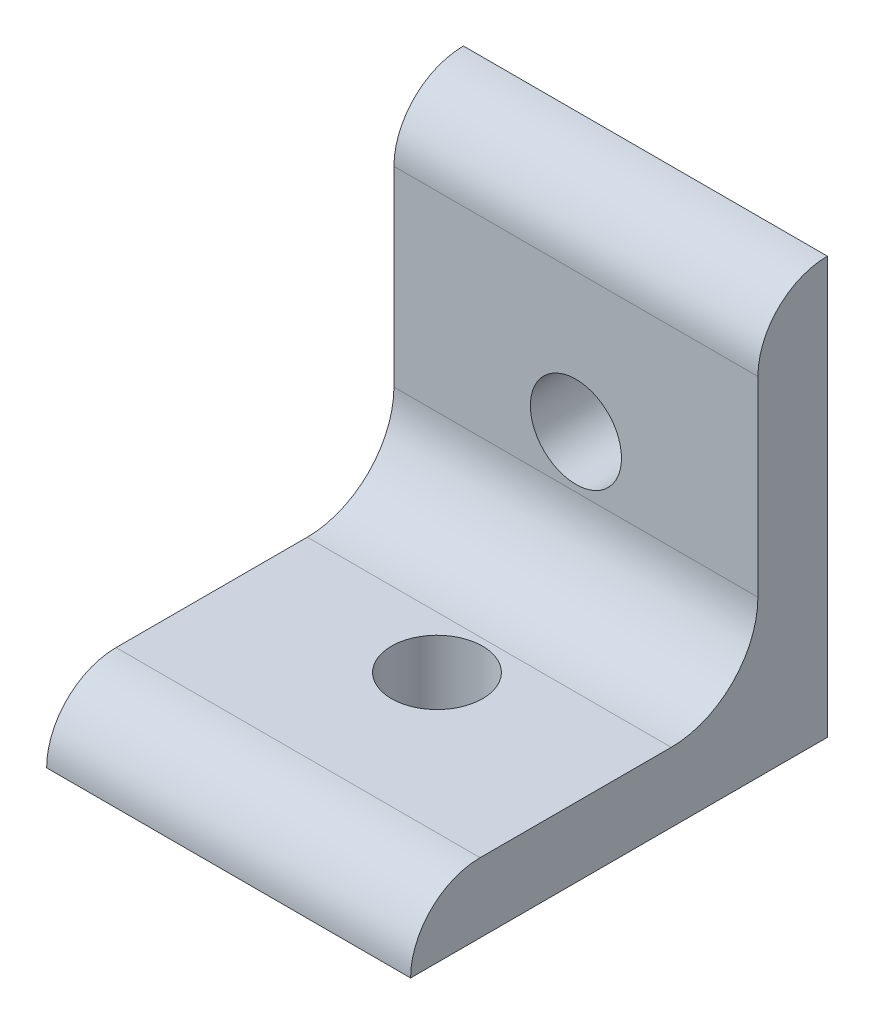
ISO-10303-21;
HEADER;
FILE_DESCRIPTION(('STEP AP214'),'2;1');
FILE_NAME('part.step','',(''),(''),'','','');
FILE_SCHEMA(('AUTOMOTIVE_DESIGN { 1 0 10303 214 1 1 1 1 }'));
ENDSEC;
DATA;
#1=APPLICATION_CONTEXT('core data for automotive mechanical design processes');
#2=APPLICATION_PROTOCOL_DEFINITION('international standard','automotive_design',2000,#1);
#3=PRODUCT_CONTEXT('',#1,'mechanical');
#4=PRODUCT('Part','Part','',(#3));
#5=PRODUCT_RELATED_PRODUCT_CATEGORY('part','',(#4));
#6=PRODUCT_DEFINITION_FORMATION('','',#4);
#7=PRODUCT_DEFINITION_CONTEXT('part definition',#1,'design');
#8=PRODUCT_DEFINITION('design','',#6,#7);
#9=PRODUCT_DEFINITION_SHAPE('','',#8);
#10=(LENGTH_UNIT() NAMED_UNIT(*) SI_UNIT(.MILLI.,.METRE.));
#11=(NAMED_UNIT(*) PLANE_ANGLE_UNIT() SI_UNIT($,.RADIAN.));
#12=(NAMED_UNIT(*) SI_UNIT($,.STERADIAN.) SOLID_ANGLE_UNIT());
#13=UNCERTAINTY_MEASURE_WITH_UNIT(LENGTH_MEASURE(1.E-05),#10,'distance_accuracy_value','');
#14=(GEOMETRIC_REPRESENTATION_CONTEXT(3) GLOBAL_UNCERTAINTY_ASSIGNED_CONTEXT((#13)) GLOBAL_UNIT_ASSIGNED_CONTEXT((#10,
#11,#12)) REPRESENTATION_CONTEXT('',''));
#15=CARTESIAN_POINT('',(0.,0.,0.));
#16=DIRECTION('',(0.,0.,1.));
#17=DIRECTION('',(1.,0.,0.));
#18=AXIS2_PLACEMENT_3D('',#15,#16,#17);
#19=CARTESIAN_POINT('',(-16.637,0.,31.7500000000007));
#20=DIRECTION('',(1.,0.,0.));
#21=DIRECTION('',(0.,0.,-1.));
#22=AXIS2_PLACEMENT_3D('',#19,#20,#21);
#23=CYLINDRICAL_SURFACE('',#22,6.34999999999924);
#24=CARTESIAN_POINT('',(16.637,0.,31.7500000000007));
#25=DIRECTION('',(1.,0.,0.));
#26=DIRECTION('',(0.,0.,-1.));
#27=AXIS2_PLACEMENT_3D('',#24,#25,#26);
#28=CIRCLE('',#27,6.34999999999924);
#29=CARTESIAN_POINT('',(16.637,6.34999999999924,31.7500000000007));
#30=VERTEX_POINT('',#29);
#31=CARTESIAN_POINT('',(16.637,0.,38.1));
#32=VERTEX_POINT('',#31);
#33=EDGE_CURVE('E132',#30,#32,#28,.T.);
#34=ORIENTED_EDGE('',*,*,#33,.F.);
#35=DIRECTION('',(1.,0.,0.));
#36=VECTOR('',#35,1.);
#37=CARTESIAN_POINT('',(-16.637,6.34999999999924,31.7500000000007));
#38=LINE('',#37,#36);
#39=CARTESIAN_POINT('',(-16.637,6.34999999999924,31.7500000000007));
#40=VERTEX_POINT('',#39);
#41=EDGE_CURVE('E115',#40,#30,#38,.T.);
#42=ORIENTED_EDGE('',*,*,#41,.F.);
#43=CARTESIAN_POINT('',(-16.637,0.,31.7500000000007));
#44=DIRECTION('',(1.,0.,0.));
#45=DIRECTION('',(0.,0.,-1.));
#46=AXIS2_PLACEMENT_3D('',#43,#44,#45);
#47=CIRCLE('',#46,6.34999999999924);
#48=CARTESIAN_POINT('',(-16.637,0.,38.1));
#49=VERTEX_POINT('',#48);
#50=EDGE_CURVE('E108',#40,#49,#47,.T.);
#51=ORIENTED_EDGE('',*,*,#50,.T.);
#52=DIRECTION('',(1.,0.,0.));
#53=VECTOR('',#52,1.);
#54=CARTESIAN_POINT('',(-16.637,0.,38.1));
#55=LINE('',#54,#53);
#56=EDGE_CURVE('E91',#49,#32,#55,.T.);
#57=ORIENTED_EDGE('',*,*,#56,.T.);
#58=EDGE_LOOP('',(#34,#42,#51,#57));
#59=FACE_BOUND('',#58,.T.);
#60=ADVANCED_FACE('F34',(#59),#23,.T.);
#61=CARTESIAN_POINT('',(-16.637,6.34999999999924,6.35));
#62=DIRECTION('',(0.,1.,0.));
#63=DIRECTION('',(0.,0.,1.));
#64=AXIS2_PLACEMENT_3D('',#61,#62,#63);
#65=PLANE('',#64);
#66=CARTESIAN_POINT('',(0.,6.34999999999924,19.05));
#67=DIRECTION('',(0.,1.,0.));
#68=DIRECTION('',(0.,0.,1.));
#69=AXIS2_PLACEMENT_3D('',#66,#67,#68);
#70=CIRCLE('',#69,4.16560000000001);
#71=CARTESIAN_POINT('',(0.,6.34999999999924,23.2156));
#72=VERTEX_POINT('',#71);
#73=EDGE_CURVE('E207',#72,#72,#70,.T.);
#74=ORIENTED_EDGE('',*,*,#73,.F.);
#75=EDGE_LOOP('',(#74));
#76=FACE_BOUND('',#75,.T.);
#77=DIRECTION('',(0.,0.,1.));
#78=VECTOR('',#77,1.);
#79=CARTESIAN_POINT('',(16.637,6.34999999999924,6.35));
#80=LINE('',#79,#78);
#81=CARTESIAN_POINT('',(16.637,6.34999999999924,14.2748));
#82=VERTEX_POINT('',#81);
#83=EDGE_CURVE('E116',#82,#30,#80,.T.);
#84=ORIENTED_EDGE('',*,*,#83,.F.);
#85=DIRECTION('',(1.,0.,0.));
#86=VECTOR('',#85,1.);
#87=CARTESIAN_POINT('',(-16.637,6.34999999999924,14.2748));
#88=LINE('',#87,#86);
#89=CARTESIAN_POINT('',(-16.637,6.34999999999924,14.2748));
#90=VERTEX_POINT('',#89);
#91=EDGE_CURVE('E49',#82,#90,#88,.F.);
#92=ORIENTED_EDGE('',*,*,#91,.T.);
#93=DIRECTION('',(0.,0.,1.));
#94=VECTOR('',#93,1.);
#95=CARTESIAN_POINT('',(-16.637,6.34999999999924,6.35));
#96=LINE('',#95,#94);
#97=EDGE_CURVE('E102',#90,#40,#96,.T.);
#98=ORIENTED_EDGE('',*,*,#97,.T.);
#99=ORIENTED_EDGE('',*,*,#41,.T.);
#100=EDGE_LOOP('',(#84,#92,#98,#99));
#101=FACE_BOUND('',#100,.T.);
#102=ADVANCED_FACE('F172',(#76,#101),#65,.T.);
#103=CARTESIAN_POINT('',(-16.637,31.75,6.35));
#104=DIRECTION('',(0.,0.,1.));
#105=DIRECTION('',(0.,-1.,0.));
#106=AXIS2_PLACEMENT_3D('',#103,#104,#105);
#107=PLANE('',#106);
#108=CARTESIAN_POINT('',(0.,19.05,6.35));
#109=DIRECTION('',(0.,0.,1.));
#110=DIRECTION('',(1.,0.,0.));
#111=AXIS2_PLACEMENT_3D('',#108,#109,#110);
#112=CIRCLE('',#111,4.16560000000001);
#113=CARTESIAN_POINT('',(4.16560000000001,19.05,6.35));
#114=VERTEX_POINT('',#113);
#115=EDGE_CURVE('E204',#114,#114,#112,.T.);
#116=ORIENTED_EDGE('',*,*,#115,.F.);
#117=EDGE_LOOP('',(#116));
#118=FACE_BOUND('',#117,.T.);
#119=DIRECTION('',(0.,-1.,0.));
#120=VECTOR('',#119,1.);
#121=CARTESIAN_POINT('',(-16.637,31.75,6.35));
#122=LINE('',#121,#120);
#123=CARTESIAN_POINT('',(-16.637,31.75,6.35));
#124=VERTEX_POINT('',#123);
#125=CARTESIAN_POINT('',(-16.637,14.2747999999992,6.35));
#126=VERTEX_POINT('',#125);
#127=EDGE_CURVE('E128',#124,#126,#122,.T.);
#128=ORIENTED_EDGE('',*,*,#127,.T.);
#129=DIRECTION('',(1.,0.,0.));
#130=VECTOR('',#129,1.);
#131=CARTESIAN_POINT('',(16.637,14.2747999999992,6.35));
#132=LINE('',#131,#130);
#133=CARTESIAN_POINT('',(16.637,14.2747999999992,6.35));
#134=VERTEX_POINT('',#133);
#135=EDGE_CURVE('E143',#126,#134,#132,.T.);
#136=ORIENTED_EDGE('',*,*,#135,.T.);
#137=DIRECTION('',(0.,-1.,0.));
#138=VECTOR('',#137,1.);
#139=CARTESIAN_POINT('',(16.637,31.75,6.35));
#140=LINE('',#139,#138);
#141=CARTESIAN_POINT('',(16.637,31.75,6.35));
#142=VERTEX_POINT('',#141);
#143=EDGE_CURVE('E118',#142,#134,#140,.T.);
#144=ORIENTED_EDGE('',*,*,#143,.F.);
#145=DIRECTION('',(1.,0.,0.));
#146=VECTOR('',#145,1.);
#147=CARTESIAN_POINT('',(-16.637,31.75,6.35));
#148=LINE('',#147,#146);
#149=EDGE_CURVE('E144',#124,#142,#148,.T.);
#150=ORIENTED_EDGE('',*,*,#149,.F.);
#151=EDGE_LOOP('',(#128,#136,#144,#150));
#152=FACE_BOUND('',#151,.T.);
#153=ADVANCED_FACE('F154',(#118,#152),#107,.T.);
#154=CARTESIAN_POINT('',(-16.637,31.75,7.57266759817096E-13));
#155=DIRECTION('',(1.,0.,0.));
#156=DIRECTION('',(0.,0.,-1.));
#157=AXIS2_PLACEMENT_3D('',#154,#155,#156);
#158=CYLINDRICAL_SURFACE('',#157,6.34999999999924);
#159=CARTESIAN_POINT('',(16.637,31.75,7.57266759817096E-13));
#160=DIRECTION('',(1.,0.,0.));
#161=DIRECTION('',(0.,0.,-1.));
#162=AXIS2_PLACEMENT_3D('',#159,#160,#161);
#163=CIRCLE('',#162,6.34999999999924);
#164=CARTESIAN_POINT('',(16.637,38.0999999999992,7.56877934458367E-13));
#165=VERTEX_POINT('',#164);
#166=EDGE_CURVE('E138',#165,#142,#163,.T.);
#167=ORIENTED_EDGE('',*,*,#166,.F.);
#168=DIRECTION('',(1.,0.,0.));
#169=VECTOR('',#168,1.);
#170=CARTESIAN_POINT('',(-16.637,38.0999999999992,7.56877934458367E-13));
#171=LINE('',#170,#169);
#172=CARTESIAN_POINT('',(-16.637,38.0999999999992,7.56877934458367E-13));
#173=VERTEX_POINT('',#172);
#174=EDGE_CURVE('E146',#173,#165,#171,.T.);
#175=ORIENTED_EDGE('',*,*,#174,.F.);
#176=CARTESIAN_POINT('',(-16.637,31.75,7.57266759817096E-13));
#177=DIRECTION('',(1.,0.,0.));
#178=DIRECTION('',(0.,0.,-1.));
#179=AXIS2_PLACEMENT_3D('',#176,#177,#178);
#180=CIRCLE('',#179,6.34999999999924);
#181=EDGE_CURVE('E125',#173,#124,#180,.T.);
#182=ORIENTED_EDGE('',*,*,#181,.T.);
#183=ORIENTED_EDGE('',*,*,#149,.T.);
#184=EDGE_LOOP('',(#167,#175,#182,#183));
#185=FACE_BOUND('',#184,.T.);
#186=ADVANCED_FACE('F162',(#185),#158,.T.);
#187=CARTESIAN_POINT('',(-16.637,0.,7.56339435525888E-13));
#188=DIRECTION('',(0.,0.,-1.));
#189=DIRECTION('',(0.,1.,0.));
#190=AXIS2_PLACEMENT_3D('',#187,#188,#189);
#191=PLANE('',#190);
#192=CARTESIAN_POINT('',(0.,19.05,0.));
#193=DIRECTION('',(0.,0.,1.));
#194=DIRECTION('',(1.,0.,0.));
#195=AXIS2_PLACEMENT_3D('',#192,#193,#194);
#196=CIRCLE('',#195,4.16560000000001);
#197=CARTESIAN_POINT('',(4.16560000000001,19.05,0.));
#198=VERTEX_POINT('',#197);
#199=EDGE_CURVE('E121',#198,#198,#196,.T.);
#200=ORIENTED_EDGE('',*,*,#199,.T.);
#201=EDGE_LOOP('',(#200));
#202=FACE_BOUND('',#201,.T.);
#203=DIRECTION('',(0.,1.,0.));
#204=VECTOR('',#203,1.);
#205=CARTESIAN_POINT('',(16.637,0.,7.56339435525888E-13));
#206=LINE('',#205,#204);
#207=CARTESIAN_POINT('',(16.637,0.,7.56339435525888E-13));
#208=VERTEX_POINT('',#207);
#209=EDGE_CURVE('E135',#208,#165,#206,.T.);
#210=ORIENTED_EDGE('',*,*,#209,.F.);
#211=DIRECTION('',(1.,0.,0.));
#212=VECTOR('',#211,1.);
#213=CARTESIAN_POINT('',(-16.637,0.,7.56339435525888E-13));
#214=LINE('',#213,#212);
#215=CARTESIAN_POINT('',(-16.637,0.,7.56339435525888E-13));
#216=VERTEX_POINT('',#215);
#217=EDGE_CURVE('E101',#216,#208,#214,.T.);
#218=ORIENTED_EDGE('',*,*,#217,.F.);
#219=DIRECTION('',(0.,1.,0.));
#220=VECTOR('',#219,1.);
#221=CARTESIAN_POINT('',(-16.637,0.,7.56339435525888E-13));
#222=LINE('',#221,#220);
#223=EDGE_CURVE('E111',#216,#173,#222,.T.);
#224=ORIENTED_EDGE('',*,*,#223,.T.);
#225=ORIENTED_EDGE('',*,*,#174,.T.);
#226=EDGE_LOOP('',(#210,#218,#224,#225));
#227=FACE_BOUND('',#226,.T.);
#228=ADVANCED_FACE('F181',(#202,#227),#191,.T.);
#229=CARTESIAN_POINT('',(-16.637,0.,38.1));
#230=DIRECTION('',(0.,-1.,0.));
#231=DIRECTION('',(0.,0.,-1.));
#232=AXIS2_PLACEMENT_3D('',#229,#230,#231);
#233=PLANE('',#232);
#234=CARTESIAN_POINT('',(0.,-7.68482499857726E-13,19.05));
#235=DIRECTION('',(0.,1.,0.));
#236=DIRECTION('',(0.,0.,1.));
#237=AXIS2_PLACEMENT_3D('',#234,#235,#236);
#238=CIRCLE('',#237,4.16560000000001);
#239=CARTESIAN_POINT('',(0.,-7.69335983807906E-13,23.2156));
#240=VERTEX_POINT('',#239);
#241=EDGE_CURVE('E205',#240,#240,#238,.T.);
#242=ORIENTED_EDGE('',*,*,#241,.T.);
#243=EDGE_LOOP('',(#242));
#244=FACE_BOUND('',#243,.T.);
#245=DIRECTION('',(0.,0.,-1.));
#246=VECTOR('',#245,1.);
#247=CARTESIAN_POINT('',(16.637,0.,38.1));
#248=LINE('',#247,#246);
#249=EDGE_CURVE('E96',#32,#208,#248,.T.);
#250=ORIENTED_EDGE('',*,*,#249,.F.);
#251=ORIENTED_EDGE('',*,*,#56,.F.);
#252=DIRECTION('',(0.,0.,-1.));
#253=VECTOR('',#252,1.);
#254=CARTESIAN_POINT('',(-16.637,0.,38.1));
#255=LINE('',#254,#253);
#256=EDGE_CURVE('E94',#49,#216,#255,.T.);
#257=ORIENTED_EDGE('',*,*,#256,.T.);
#258=ORIENTED_EDGE('',*,*,#217,.T.);
#259=EDGE_LOOP('',(#250,#251,#257,#258));
#260=FACE_BOUND('',#259,.T.);
#261=ADVANCED_FACE('F93',(#244,#260),#233,.T.);
#262=CARTESIAN_POINT('',(-16.637,0.,31.7500000000007));
#263=DIRECTION('',(1.,0.,0.));
#264=DIRECTION('',(0.,0.,-1.));
#265=AXIS2_PLACEMENT_3D('',#262,#263,#264);
#266=PLANE('',#265);
#267=ORIENTED_EDGE('',*,*,#50,.F.);
#268=ORIENTED_EDGE('',*,*,#97,.F.);
#269=CARTESIAN_POINT('',(-16.637,14.2747999999992,14.2748));
#270=DIRECTION('',(1.,0.,0.));
#271=DIRECTION('',(0.,0.,-1.));
#272=AXIS2_PLACEMENT_3D('',#269,#270,#271);
#273=CIRCLE('',#272,7.9248);
#274=EDGE_CURVE('E11',#90,#126,#273,.T.);
#275=ORIENTED_EDGE('',*,*,#274,.T.);
#276=ORIENTED_EDGE('',*,*,#127,.F.);
#277=ORIENTED_EDGE('',*,*,#181,.F.);
#278=ORIENTED_EDGE('',*,*,#223,.F.);
#279=ORIENTED_EDGE('',*,*,#256,.F.);
#280=EDGE_LOOP('',(#267,#268,#275,#276,#277,#278,#279));
#281=FACE_BOUND('',#280,.T.);
#282=ADVANCED_FACE('F107',(#281),#266,.F.);
#283=CARTESIAN_POINT('',(16.637,0.,31.7500000000007));
#284=DIRECTION('',(1.,0.,0.));
#285=DIRECTION('',(0.,0.,-1.));
#286=AXIS2_PLACEMENT_3D('',#283,#284,#285);
#287=PLANE('',#286);
#288=ORIENTED_EDGE('',*,*,#33,.T.);
#289=ORIENTED_EDGE('',*,*,#249,.T.);
#290=ORIENTED_EDGE('',*,*,#209,.T.);
#291=ORIENTED_EDGE('',*,*,#166,.T.);
#292=ORIENTED_EDGE('',*,*,#143,.T.);
#293=CARTESIAN_POINT('',(16.637,14.2747999999992,14.2748));
#294=DIRECTION('',(1.,0.,0.));
#295=DIRECTION('',(0.,0.,-1.));
#296=AXIS2_PLACEMENT_3D('',#293,#294,#295);
#297=CIRCLE('',#296,7.9248);
#298=EDGE_CURVE('E42',#134,#82,#297,.F.);
#299=ORIENTED_EDGE('',*,*,#298,.T.);
#300=ORIENTED_EDGE('',*,*,#83,.T.);
#301=EDGE_LOOP('',(#288,#289,#290,#291,#292,#299,#300));
#302=FACE_BOUND('',#301,.T.);
#303=ADVANCED_FACE('F158',(#302),#287,.T.);
#304=CARTESIAN_POINT('',(0.,19.05,6.35));
#305=DIRECTION('',(0.,0.,1.));
#306=DIRECTION('',(1.,0.,0.));
#307=AXIS2_PLACEMENT_3D('',#304,#305,#306);
#308=CYLINDRICAL_SURFACE('',#307,4.16560000000001);
#309=ORIENTED_EDGE('',*,*,#199,.F.);
#310=EDGE_LOOP('',(#309));
#311=FACE_BOUND('',#310,.T.);
#312=ORIENTED_EDGE('',*,*,#115,.T.);
#313=EDGE_LOOP('',(#312));
#314=FACE_BOUND('',#313,.T.);
#315=ADVANCED_FACE('F168',(#311,#314),#308,.F.);
#316=CARTESIAN_POINT('',(0.,6.34999999999924,19.05));
#317=DIRECTION('',(0.,1.,0.));
#318=DIRECTION('',(0.,0.,1.));
#319=AXIS2_PLACEMENT_3D('',#316,#317,#318);
#320=CYLINDRICAL_SURFACE('',#319,4.16560000000001);
#321=ORIENTED_EDGE('',*,*,#241,.F.);
#322=EDGE_LOOP('',(#321));
#323=FACE_BOUND('',#322,.T.);
#324=ORIENTED_EDGE('',*,*,#73,.T.);
#325=EDGE_LOOP('',(#324));
#326=FACE_BOUND('',#325,.T.);
#327=ADVANCED_FACE('F164',(#323,#326),#320,.F.);
#328=CARTESIAN_POINT('',(-16.637,14.2747999999992,14.2748));
#329=DIRECTION('',(-1.,0.,0.));
#330=DIRECTION('',(0.,0.,1.));
#331=AXIS2_PLACEMENT_3D('',#328,#329,#330);
#332=CYLINDRICAL_SURFACE('',#331,7.9248);
#333=ORIENTED_EDGE('',*,*,#274,.F.);
#334=ORIENTED_EDGE('',*,*,#91,.F.);
#335=ORIENTED_EDGE('',*,*,#298,.F.);
#336=ORIENTED_EDGE('',*,*,#135,.F.);
#337=EDGE_LOOP('',(#333,#334,#335,#336));
#338=FACE_BOUND('',#337,.T.);
#339=ADVANCED_FACE('F36',(#338),#332,.F.);
#340=CLOSED_SHELL('',(#60,#102,#153,#186,#228,#261,#282,#303,#315,#327,#339));
#341=MANIFOLD_SOLID_BREP('B2',#340);
#342=ADVANCED_BREP_SHAPE_REPRESENTATION('',(#18,#341),#14);
#343=SHAPE_DEFINITION_REPRESENTATION(#9,#342);
ENDSEC;
END-ISO-10303-21;
